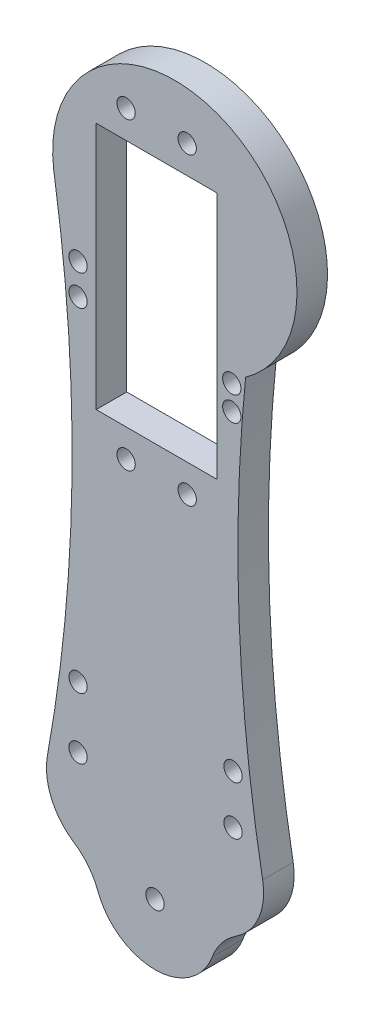
ISO-10303-21;
HEADER;
FILE_DESCRIPTION(('STEP AP214'),'2;1');
FILE_NAME('part.step','',(''),(''),'','','');
FILE_SCHEMA(('AUTOMOTIVE_DESIGN { 1 0 10303 214 1 1 1 1 }'));
ENDSEC;
DATA;
#1=APPLICATION_CONTEXT('core data for automotive mechanical design processes');
#2=APPLICATION_PROTOCOL_DEFINITION('international standard','automotive_design',2000,#1);
#3=PRODUCT_CONTEXT('',#1,'mechanical');
#4=PRODUCT('Part','Part','',(#3));
#5=PRODUCT_RELATED_PRODUCT_CATEGORY('part','',(#4));
#6=PRODUCT_DEFINITION_FORMATION('','',#4);
#7=PRODUCT_DEFINITION_CONTEXT('part definition',#1,'design');
#8=PRODUCT_DEFINITION('design','',#6,#7);
#9=PRODUCT_DEFINITION_SHAPE('','',#8);
#10=(LENGTH_UNIT() NAMED_UNIT(*) SI_UNIT(.MILLI.,.METRE.));
#11=(NAMED_UNIT(*) PLANE_ANGLE_UNIT() SI_UNIT($,.RADIAN.));
#12=(NAMED_UNIT(*) SI_UNIT($,.STERADIAN.) SOLID_ANGLE_UNIT());
#13=UNCERTAINTY_MEASURE_WITH_UNIT(LENGTH_MEASURE(1.E-05),#10,'distance_accuracy_value','');
#14=(GEOMETRIC_REPRESENTATION_CONTEXT(3) GLOBAL_UNCERTAINTY_ASSIGNED_CONTEXT((#13)) GLOBAL_UNIT_ASSIGNED_CONTEXT((#10,
#11,#12)) REPRESENTATION_CONTEXT('',''));
#15=CARTESIAN_POINT('',(0.,0.,0.));
#16=DIRECTION('',(0.,0.,1.));
#17=DIRECTION('',(1.,0.,0.));
#18=AXIS2_PLACEMENT_3D('',#15,#16,#17);
#19=CARTESIAN_POINT('',(263.569146060618,56.3388949776364,5.));
#20=DIRECTION('',(0.,0.,-1.));
#21=DIRECTION('',(-1.,0.,0.));
#22=AXIS2_PLACEMENT_3D('',#19,#20,#21);
#23=CYLINDRICAL_SURFACE('',#22,250.);
#24=CARTESIAN_POINT('',(263.569146060618,56.3388949776364,5.));
#25=DIRECTION('',(0.,0.,1.));
#26=DIRECTION('',(1.,0.,0.));
#27=AXIS2_PLACEMENT_3D('',#24,#25,#26);
#28=CIRCLE('',#27,250.);
#29=CARTESIAN_POINT('',(17.6154614259409,11.5417408869401,5.));
#30=VERTEX_POINT('',#29);
#31=CARTESIAN_POINT('',(14.8299436653512,81.4149630858208,5.));
#32=VERTEX_POINT('',#31);
#33=EDGE_CURVE('E179',#30,#32,#28,.F.);
#34=ORIENTED_EDGE('',*,*,#33,.F.);
#35=DIRECTION('',(0.,0.,-1.));
#36=VECTOR('',#35,1.);
#37=CARTESIAN_POINT('',(17.6154614259408,11.5417408869401,5.));
#38=LINE('',#37,#36);
#39=CARTESIAN_POINT('',(17.6154614259409,11.5417408869401,0.));
#40=VERTEX_POINT('',#39);
#41=EDGE_CURVE('E211',#30,#40,#38,.T.);
#42=ORIENTED_EDGE('',*,*,#41,.T.);
#43=CARTESIAN_POINT('',(263.569146060618,56.3388949776364,0.));
#44=DIRECTION('',(0.,0.,1.));
#45=DIRECTION('',(1.,0.,0.));
#46=AXIS2_PLACEMENT_3D('',#43,#44,#45);
#47=CIRCLE('',#46,250.);
#48=CARTESIAN_POINT('',(14.8299436653512,81.4149630858208,0.));
#49=VERTEX_POINT('',#48);
#50=EDGE_CURVE('E175',#40,#49,#47,.F.);
#51=ORIENTED_EDGE('',*,*,#50,.T.);
#52=DIRECTION('',(0.,0.,-1.));
#53=VECTOR('',#52,1.);
#54=CARTESIAN_POINT('',(14.8299436653512,81.4149630858208,5.));
#55=LINE('',#54,#53);
#56=EDGE_CURVE('E208',#32,#49,#55,.T.);
#57=ORIENTED_EDGE('',*,*,#56,.F.);
#58=EDGE_LOOP('',(#34,#42,#51,#57));
#59=FACE_BOUND('',#58,.T.);
#60=ADVANCED_FACE('F34',(#59),#23,.F.);
#61=CARTESIAN_POINT('',(3.24159201282626,97.7155798219269,5.));
#62=DIRECTION('',(0.,0.,-1.));
#63=DIRECTION('',(-1.,0.,0.));
#64=AXIS2_PLACEMENT_3D('',#61,#62,#63);
#65=CYLINDRICAL_SURFACE('',#64,20.);
#66=CARTESIAN_POINT('',(3.24159201282626,97.7155798219269,0.));
#67=DIRECTION('',(0.,0.,1.));
#68=DIRECTION('',(1.,0.,0.));
#69=AXIS2_PLACEMENT_3D('',#66,#67,#68);
#70=CIRCLE('',#69,20.);
#71=CARTESIAN_POINT('',(-16.5765244711894,95.0244352650541,0.));
#72=VERTEX_POINT('',#71);
#73=EDGE_CURVE('E194',#49,#72,#70,.T.);
#74=ORIENTED_EDGE('',*,*,#73,.T.);
#75=DIRECTION('',(0.,0.,-1.));
#76=VECTOR('',#75,1.);
#77=CARTESIAN_POINT('',(-16.5765244711894,95.0244352650541,5.));
#78=LINE('',#77,#76);
#79=CARTESIAN_POINT('',(-16.5765244711894,95.0244352650541,5.));
#80=VERTEX_POINT('',#79);
#81=EDGE_CURVE('E206',#80,#72,#78,.T.);
#82=ORIENTED_EDGE('',*,*,#81,.F.);
#83=CARTESIAN_POINT('',(3.24159201282626,97.7155798219269,5.));
#84=DIRECTION('',(0.,0.,1.));
#85=DIRECTION('',(1.,0.,0.));
#86=AXIS2_PLACEMENT_3D('',#83,#84,#85);
#87=CIRCLE('',#86,20.);
#88=EDGE_CURVE('E181',#32,#80,#87,.T.);
#89=ORIENTED_EDGE('',*,*,#88,.F.);
#90=ORIENTED_EDGE('',*,*,#56,.T.);
#91=EDGE_LOOP('',(#74,#82,#89,#90));
#92=FACE_BOUND('',#91,.T.);
#93=ADVANCED_FACE('F276',(#92),#65,.T.);
#94=CARTESIAN_POINT('',(-2.18344410291627,-0.329576970241774,5.));
#95=DIRECTION('',(-0.98879905314421,-0.149252914548141,0.));
#96=DIRECTION('',(0.149252914548141,-0.98879905314421,0.));
#97=AXIS2_PLACEMENT_3D('',#94,#95,#96);
#98=PLANE('',#97);
#99=DIRECTION('',(-0.149252914548141,0.98879905314421,0.));
#100=VECTOR('',#99,1.);
#101=CARTESIAN_POINT('',(-2.18344410291627,-0.329576970241774,0.));
#102=LINE('',#101,#100);
#103=CARTESIAN_POINT('',(-16.369382774566,93.6521236146717,0.));
#104=VERTEX_POINT('',#103);
#105=EDGE_CURVE('E197',#104,#72,#102,.T.);
#106=ORIENTED_EDGE('',*,*,#105,.F.);
#107=DIRECTION('',(0.,0.,-1.));
#108=VECTOR('',#107,1.);
#109=CARTESIAN_POINT('',(-16.369382774566,93.6521236146717,5.));
#110=LINE('',#109,#108);
#111=CARTESIAN_POINT('',(-16.369382774566,93.6521236146717,5.));
#112=VERTEX_POINT('',#111);
#113=EDGE_CURVE('E192',#112,#104,#110,.T.);
#114=ORIENTED_EDGE('',*,*,#113,.F.);
#115=DIRECTION('',(-0.149252914548141,0.98879905314421,0.));
#116=VECTOR('',#115,1.);
#117=CARTESIAN_POINT('',(-2.18344410291627,-0.329576970241774,5.));
#118=LINE('',#117,#116);
#119=EDGE_CURVE('E184',#112,#80,#118,.T.);
#120=ORIENTED_EDGE('',*,*,#119,.T.);
#121=ORIENTED_EDGE('',*,*,#81,.T.);
#122=EDGE_LOOP('',(#106,#114,#120,#121));
#123=FACE_BOUND('',#122,.T.);
#124=ADVANCED_FACE('F282',(#123),#98,.T.);
#125=CARTESIAN_POINT('',(-263.569146060618,56.3388949776364,5.));
#126=DIRECTION('',(0.,0.,-1.));
#127=DIRECTION('',(-1.,0.,0.));
#128=AXIS2_PLACEMENT_3D('',#125,#126,#127);
#129=CYLINDRICAL_SURFACE('',#128,250.);
#130=CARTESIAN_POINT('',(-263.569146060618,56.3388949776364,0.));
#131=DIRECTION('',(0.,0.,1.));
#132=DIRECTION('',(1.,0.,0.));
#133=AXIS2_PLACEMENT_3D('',#130,#131,#132);
#134=CIRCLE('',#133,250.);
#135=CARTESIAN_POINT('',(-17.6154614259409,11.5417408869394,0.));
#136=VERTEX_POINT('',#135);
#137=EDGE_CURVE('E200',#136,#104,#134,.T.);
#138=ORIENTED_EDGE('',*,*,#137,.F.);
#139=DIRECTION('',(0.,0.,-1.));
#140=VECTOR('',#139,1.);
#141=CARTESIAN_POINT('',(-17.6154614259409,11.5417408869394,5.));
#142=LINE('',#141,#140);
#143=CARTESIAN_POINT('',(-17.615461425941,11.5417408869395,5.));
#144=VERTEX_POINT('',#143);
#145=EDGE_CURVE('E224',#136,#144,#142,.F.);
#146=ORIENTED_EDGE('',*,*,#145,.T.);
#147=CARTESIAN_POINT('',(-263.569146060618,56.3388949776364,5.));
#148=DIRECTION('',(0.,0.,1.));
#149=DIRECTION('',(1.,0.,0.));
#150=AXIS2_PLACEMENT_3D('',#147,#148,#149);
#151=CIRCLE('',#150,250.);
#152=EDGE_CURVE('E187',#144,#112,#151,.T.);
#153=ORIENTED_EDGE('',*,*,#152,.T.);
#154=ORIENTED_EDGE('',*,*,#113,.T.);
#155=EDGE_LOOP('',(#138,#146,#153,#154));
#156=FACE_BOUND('',#155,.T.);
#157=ADVANCED_FACE('F330',(#156),#129,.F.);
#158=CARTESIAN_POINT('',(0.,0.,5.));
#159=DIRECTION('',(0.,0.,-1.));
#160=DIRECTION('',(-1.,0.,0.));
#161=AXIS2_PLACEMENT_3D('',#158,#159,#160);
#162=CYLINDRICAL_SURFACE('',#161,10.);
#163=CARTESIAN_POINT('',(0.,0.,5.));
#164=DIRECTION('',(0.,0.,1.));
#165=DIRECTION('',(1.,0.,0.));
#166=AXIS2_PLACEMENT_3D('',#163,#164,#165);
#167=CIRCLE('',#166,10.);
#168=CARTESIAN_POINT('',(-9.37212768633296,-3.48758120064195,5.));
#169=VERTEX_POINT('',#168);
#170=CARTESIAN_POINT('',(9.37212768633315,-3.48758120064144,5.));
#171=VERTEX_POINT('',#170);
#172=EDGE_CURVE('E189',#169,#171,#167,.T.);
#173=ORIENTED_EDGE('',*,*,#172,.F.);
#174=DIRECTION('',(0.,0.,-1.));
#175=VECTOR('',#174,1.);
#176=CARTESIAN_POINT('',(-9.37212768633296,-3.48758120064195,5.));
#177=LINE('',#176,#175);
#178=CARTESIAN_POINT('',(-9.37212768633296,-3.48758120064195,0.));
#179=VERTEX_POINT('',#178);
#180=EDGE_CURVE('E228',#169,#179,#177,.T.);
#181=ORIENTED_EDGE('',*,*,#180,.T.);
#182=CARTESIAN_POINT('',(0.,0.,0.));
#183=DIRECTION('',(0.,0.,1.));
#184=DIRECTION('',(1.,0.,0.));
#185=AXIS2_PLACEMENT_3D('',#182,#183,#184);
#186=CIRCLE('',#185,10.);
#187=CARTESIAN_POINT('',(9.37212768633315,-3.48758120064144,0.));
#188=VERTEX_POINT('',#187);
#189=EDGE_CURVE('E182',#179,#188,#186,.T.);
#190=ORIENTED_EDGE('',*,*,#189,.T.);
#191=DIRECTION('',(0.,0.,-1.));
#192=VECTOR('',#191,1.);
#193=CARTESIAN_POINT('',(9.37212768633315,-3.48758120064144,5.));
#194=LINE('',#193,#192);
#195=EDGE_CURVE('E226',#188,#171,#194,.F.);
#196=ORIENTED_EDGE('',*,*,#195,.T.);
#197=EDGE_LOOP('',(#173,#181,#190,#196));
#198=FACE_BOUND('',#197,.T.);
#199=ADVANCED_FACE('F312',(#198),#162,.T.);
#200=CARTESIAN_POINT('',(0.,0.,5.));
#201=DIRECTION('',(0.,0.,1.));
#202=DIRECTION('',(1.,0.,0.));
#203=AXIS2_PLACEMENT_3D('',#200,#201,#202);
#204=PLANE('',#203);
#205=CARTESIAN_POINT('',(12.77,24.54,5.));
#206=DIRECTION('',(0.,0.,-1.));
#207=DIRECTION('',(-1.,0.,0.));
#208=AXIS2_PLACEMENT_3D('',#205,#206,#207);
#209=CIRCLE('',#208,1.5);
#210=CARTESIAN_POINT('',(11.27,24.54,5.));
#211=VERTEX_POINT('',#210);
#212=EDGE_CURVE('E514',#211,#211,#209,.T.);
#213=ORIENTED_EDGE('',*,*,#212,.T.);
#214=EDGE_LOOP('',(#213));
#215=FACE_BOUND('',#214,.T.);
#216=CARTESIAN_POINT('',(12.57,75.41,5.));
#217=DIRECTION('',(0.,0.,-1.));
#218=DIRECTION('',(-1.,0.,0.));
#219=AXIS2_PLACEMENT_3D('',#216,#217,#218);
#220=CIRCLE('',#219,1.5);
#221=CARTESIAN_POINT('',(11.07,75.41,5.));
#222=VERTEX_POINT('',#221);
#223=EDGE_CURVE('E518',#222,#222,#220,.T.);
#224=ORIENTED_EDGE('',*,*,#223,.T.);
#225=EDGE_LOOP('',(#224));
#226=FACE_BOUND('',#225,.T.);
#227=CARTESIAN_POINT('',(12.57,79.41,5.));
#228=DIRECTION('',(0.,0.,-1.));
#229=DIRECTION('',(-1.,0.,0.));
#230=AXIS2_PLACEMENT_3D('',#227,#228,#229);
#231=CIRCLE('',#230,1.5);
#232=CARTESIAN_POINT('',(11.07,79.41,5.));
#233=VERTEX_POINT('',#232);
#234=EDGE_CURVE('E528',#233,#233,#231,.T.);
#235=ORIENTED_EDGE('',*,*,#234,.T.);
#236=EDGE_LOOP('',(#235));
#237=FACE_BOUND('',#236,.T.);
#238=CARTESIAN_POINT('',(12.77,16.54,5.));
#239=DIRECTION('',(0.,0.,-1.));
#240=DIRECTION('',(-1.,0.,0.));
#241=AXIS2_PLACEMENT_3D('',#238,#239,#240);
#242=CIRCLE('',#241,1.5);
#243=CARTESIAN_POINT('',(11.27,16.54,5.));
#244=VERTEX_POINT('',#243);
#245=EDGE_CURVE('E534',#244,#244,#242,.T.);
#246=ORIENTED_EDGE('',*,*,#245,.T.);
#247=EDGE_LOOP('',(#246));
#248=FACE_BOUND('',#247,.T.);
#249=CARTESIAN_POINT('',(-12.6,24.5,5.));
#250=DIRECTION('',(0.,0.,1.));
#251=DIRECTION('',(1.,0.,0.));
#252=AXIS2_PLACEMENT_3D('',#249,#250,#251);
#253=CIRCLE('',#252,1.5);
#254=CARTESIAN_POINT('',(-11.1,24.5,5.));
#255=VERTEX_POINT('',#254);
#256=EDGE_CURVE('E554',#255,#255,#253,.T.);
#257=ORIENTED_EDGE('',*,*,#256,.F.);
#258=EDGE_LOOP('',(#257));
#259=FACE_BOUND('',#258,.T.);
#260=CARTESIAN_POINT('',(-12.6,79.11,5.));
#261=DIRECTION('',(0.,0.,1.));
#262=DIRECTION('',(1.,0.,0.));
#263=AXIS2_PLACEMENT_3D('',#260,#261,#262);
#264=CIRCLE('',#263,1.5);
#265=CARTESIAN_POINT('',(-11.1,79.11,5.));
#266=VERTEX_POINT('',#265);
#267=EDGE_CURVE('E551',#266,#266,#264,.T.);
#268=ORIENTED_EDGE('',*,*,#267,.F.);
#269=EDGE_LOOP('',(#268));
#270=FACE_BOUND('',#269,.T.);
#271=CARTESIAN_POINT('',(-12.6,84.11,5.));
#272=DIRECTION('',(0.,0.,1.));
#273=DIRECTION('',(1.,0.,0.));
#274=AXIS2_PLACEMENT_3D('',#271,#272,#273);
#275=CIRCLE('',#274,1.5);
#276=CARTESIAN_POINT('',(-11.1,84.11,5.));
#277=VERTEX_POINT('',#276);
#278=EDGE_CURVE('E543',#277,#277,#275,.T.);
#279=ORIENTED_EDGE('',*,*,#278,.F.);
#280=EDGE_LOOP('',(#279));
#281=FACE_BOUND('',#280,.T.);
#282=CARTESIAN_POINT('',(-12.6,14.5,5.));
#283=DIRECTION('',(0.,0.,1.));
#284=DIRECTION('',(1.,0.,0.));
#285=AXIS2_PLACEMENT_3D('',#282,#283,#284);
#286=CIRCLE('',#285,1.5);
#287=CARTESIAN_POINT('',(-11.1,14.5,5.));
#288=VERTEX_POINT('',#287);
#289=EDGE_CURVE('E560',#288,#288,#286,.T.);
#290=ORIENTED_EDGE('',*,*,#289,.F.);
#291=EDGE_LOOP('',(#290));
#292=FACE_BOUND('',#291,.T.);
#293=DIRECTION('',(0.,-1.,0.));
#294=VECTOR('',#293,1.);
#295=CARTESIAN_POINT('',(-9.63243502849118,105.19,5.));
#296=LINE('',#295,#294);
#297=CARTESIAN_POINT('',(-9.63243502849118,105.19,5.));
#298=VERTEX_POINT('',#297);
#299=CARTESIAN_POINT('',(-9.63243502849117,64.59,5.));
#300=VERTEX_POINT('',#299);
#301=EDGE_CURVE('E49',#298,#300,#296,.T.);
#302=ORIENTED_EDGE('',*,*,#301,.F.);
#303=DIRECTION('',(-1.,0.,0.));
#304=VECTOR('',#303,1.);
#305=CARTESIAN_POINT('',(-9.63243502849118,105.19,5.));
#306=LINE('',#305,#304);
#307=CARTESIAN_POINT('',(10.1675649715088,105.19,5.));
#308=VERTEX_POINT('',#307);
#309=EDGE_CURVE('E148',#308,#298,#306,.T.);
#310=ORIENTED_EDGE('',*,*,#309,.F.);
#311=DIRECTION('',(0.,1.,0.));
#312=VECTOR('',#311,1.);
#313=CARTESIAN_POINT('',(10.1675649715088,105.19,5.));
#314=LINE('',#313,#312);
#315=CARTESIAN_POINT('',(10.1675649715088,64.59,5.));
#316=VERTEX_POINT('',#315);
#317=EDGE_CURVE('E132',#316,#308,#314,.T.);
#318=ORIENTED_EDGE('',*,*,#317,.F.);
#319=DIRECTION('',(1.,0.,0.));
#320=VECTOR('',#319,1.);
#321=CARTESIAN_POINT('',(-9.63243502849117,64.59,5.));
#322=LINE('',#321,#320);
#323=EDGE_CURVE('E141',#300,#316,#322,.T.);
#324=ORIENTED_EDGE('',*,*,#323,.F.);
#325=EDGE_LOOP('',(#302,#310,#318,#324));
#326=FACE_BOUND('',#325,.T.);
#327=CARTESIAN_POINT('',(5.26756497150882,109.78,5.));
#328=DIRECTION('',(0.,0.,1.));
#329=DIRECTION('',(1.,0.,0.));
#330=AXIS2_PLACEMENT_3D('',#327,#328,#329);
#331=CIRCLE('',#330,1.5);
#332=CARTESIAN_POINT('',(6.76756497150882,109.78,5.));
#333=VERTEX_POINT('',#332);
#334=EDGE_CURVE('E158',#333,#333,#331,.T.);
#335=ORIENTED_EDGE('',*,*,#334,.F.);
#336=EDGE_LOOP('',(#335));
#337=FACE_BOUND('',#336,.T.);
#338=CARTESIAN_POINT('',(-4.73243502849118,60.,5.));
#339=DIRECTION('',(0.,0.,1.));
#340=DIRECTION('',(1.,0.,0.));
#341=AXIS2_PLACEMENT_3D('',#338,#339,#340);
#342=CIRCLE('',#341,1.5);
#343=CARTESIAN_POINT('',(-3.23243502849118,60.,5.));
#344=VERTEX_POINT('',#343);
#345=EDGE_CURVE('E162',#344,#344,#342,.T.);
#346=ORIENTED_EDGE('',*,*,#345,.F.);
#347=EDGE_LOOP('',(#346));
#348=FACE_BOUND('',#347,.T.);
#349=CARTESIAN_POINT('',(5.26756497150882,60.,5.));
#350=DIRECTION('',(0.,0.,1.));
#351=DIRECTION('',(1.,0.,0.));
#352=AXIS2_PLACEMENT_3D('',#349,#350,#351);
#353=CIRCLE('',#352,1.5);
#354=CARTESIAN_POINT('',(6.76756497150883,60.,5.));
#355=VERTEX_POINT('',#354);
#356=EDGE_CURVE('E155',#355,#355,#353,.T.);
#357=ORIENTED_EDGE('',*,*,#356,.F.);
#358=EDGE_LOOP('',(#357));
#359=FACE_BOUND('',#358,.T.);
#360=CARTESIAN_POINT('',(-4.73243502849118,109.78,5.));
#361=DIRECTION('',(0.,0.,1.));
#362=DIRECTION('',(1.,0.,0.));
#363=AXIS2_PLACEMENT_3D('',#360,#361,#362);
#364=CIRCLE('',#363,1.5);
#365=CARTESIAN_POINT('',(-3.23243502849118,109.78,5.));
#366=VERTEX_POINT('',#365);
#367=EDGE_CURVE('E167',#366,#366,#364,.T.);
#368=ORIENTED_EDGE('',*,*,#367,.F.);
#369=EDGE_LOOP('',(#368));
#370=FACE_BOUND('',#369,.T.);
#371=CARTESIAN_POINT('',(0.,0.,5.));
#372=DIRECTION('',(0.,0.,1.));
#373=DIRECTION('',(1.,0.,0.));
#374=AXIS2_PLACEMENT_3D('',#371,#372,#373);
#375=CIRCLE('',#374,1.5);
#376=CARTESIAN_POINT('',(1.5,0.,5.));
#377=VERTEX_POINT('',#376);
#378=EDGE_CURVE('E176',#377,#377,#375,.T.);
#379=ORIENTED_EDGE('',*,*,#378,.F.);
#380=EDGE_LOOP('',(#379));
#381=FACE_BOUND('',#380,.T.);
#382=CARTESIAN_POINT('',(-7.77731404055385,9.74985472331157,5.));
#383=DIRECTION('',(0.,0.,1.));
#384=DIRECTION('',(1.,0.,0.));
#385=AXIS2_PLACEMENT_3D('',#382,#383,#384);
#386=CIRCLE('',#385,10.);
#387=CARTESIAN_POINT('',(-13.2607847066099,1.38734616101384,5.));
#388=VERTEX_POINT('',#387);
#389=EDGE_CURVE('E219',#144,#388,#386,.T.);
#390=ORIENTED_EDGE('',*,*,#389,.T.);
#391=CARTESIAN_POINT('',(-18.7442553726659,-6.9751624012839,5.));
#392=DIRECTION('',(0.,0.,1.));
#393=DIRECTION('',(1.,0.,0.));
#394=AXIS2_PLACEMENT_3D('',#391,#392,#393);
#395=CIRCLE('',#394,10.);
#396=EDGE_CURVE('E238',#388,#169,#395,.F.);
#397=ORIENTED_EDGE('',*,*,#396,.T.);
#398=ORIENTED_EDGE('',*,*,#172,.T.);
#399=CARTESIAN_POINT('',(18.7442553726663,-6.97516240128287,5.));
#400=DIRECTION('',(0.,0.,1.));
#401=DIRECTION('',(1.,0.,0.));
#402=AXIS2_PLACEMENT_3D('',#399,#400,#401);
#403=CIRCLE('',#402,10.);
#404=CARTESIAN_POINT('',(13.26078470661,1.3873461610147,5.));
#405=VERTEX_POINT('',#404);
#406=EDGE_CURVE('E242',#171,#405,#403,.F.);
#407=ORIENTED_EDGE('',*,*,#406,.T.);
#408=CARTESIAN_POINT('',(7.77731404055373,9.74985472331227,5.));
#409=DIRECTION('',(0.,0.,1.));
#410=DIRECTION('',(1.,0.,0.));
#411=AXIS2_PLACEMENT_3D('',#408,#409,#410);
#412=CIRCLE('',#411,10.);
#413=EDGE_CURVE('E222',#405,#30,#412,.T.);
#414=ORIENTED_EDGE('',*,*,#413,.T.);
#415=ORIENTED_EDGE('',*,*,#33,.T.);
#416=ORIENTED_EDGE('',*,*,#88,.T.);
#417=ORIENTED_EDGE('',*,*,#119,.F.);
#418=ORIENTED_EDGE('',*,*,#152,.F.);
#419=EDGE_LOOP('',(#390,#397,#398,#407,#414,#415,#416,#417,#418));
#420=FACE_BOUND('',#419,.T.);
#421=ADVANCED_FACE('F145',(#215,#226,#237,#248,#259,#270,#281,#292,#326,#337,#348,#359,#370,
#381,#420),#204,.T.);
#422=CARTESIAN_POINT('',(0.,0.,0.));
#423=DIRECTION('',(0.,0.,1.));
#424=DIRECTION('',(1.,0.,0.));
#425=AXIS2_PLACEMENT_3D('',#422,#423,#424);
#426=PLANE('',#425);
#427=CARTESIAN_POINT('',(12.77,24.54,0.));
#428=DIRECTION('',(0.,0.,-1.));
#429=DIRECTION('',(-1.,0.,0.));
#430=AXIS2_PLACEMENT_3D('',#427,#428,#429);
#431=CIRCLE('',#430,1.5);
#432=CARTESIAN_POINT('',(11.27,24.54,0.));
#433=VERTEX_POINT('',#432);
#434=EDGE_CURVE('E517',#433,#433,#431,.T.);
#435=ORIENTED_EDGE('',*,*,#434,.F.);
#436=EDGE_LOOP('',(#435));
#437=FACE_BOUND('',#436,.T.);
#438=CARTESIAN_POINT('',(12.57,75.41,0.));
#439=DIRECTION('',(0.,0.,-1.));
#440=DIRECTION('',(-1.,0.,0.));
#441=AXIS2_PLACEMENT_3D('',#438,#439,#440);
#442=CIRCLE('',#441,1.5);
#443=CARTESIAN_POINT('',(11.07,75.41,0.));
#444=VERTEX_POINT('',#443);
#445=EDGE_CURVE('E523',#444,#444,#442,.T.);
#446=ORIENTED_EDGE('',*,*,#445,.F.);
#447=EDGE_LOOP('',(#446));
#448=FACE_BOUND('',#447,.T.);
#449=CARTESIAN_POINT('',(12.57,79.41,0.));
#450=DIRECTION('',(0.,0.,-1.));
#451=DIRECTION('',(-1.,0.,0.));
#452=AXIS2_PLACEMENT_3D('',#449,#450,#451);
#453=CIRCLE('',#452,1.5);
#454=CARTESIAN_POINT('',(11.07,79.41,0.));
#455=VERTEX_POINT('',#454);
#456=EDGE_CURVE('E531',#455,#455,#453,.T.);
#457=ORIENTED_EDGE('',*,*,#456,.F.);
#458=EDGE_LOOP('',(#457));
#459=FACE_BOUND('',#458,.T.);
#460=CARTESIAN_POINT('',(12.77,16.54,0.));
#461=DIRECTION('',(0.,0.,-1.));
#462=DIRECTION('',(-1.,0.,0.));
#463=AXIS2_PLACEMENT_3D('',#460,#461,#462);
#464=CIRCLE('',#463,1.5);
#465=CARTESIAN_POINT('',(11.27,16.54,0.));
#466=VERTEX_POINT('',#465);
#467=EDGE_CURVE('E520',#466,#466,#464,.T.);
#468=ORIENTED_EDGE('',*,*,#467,.F.);
#469=EDGE_LOOP('',(#468));
#470=FACE_BOUND('',#469,.T.);
#471=CARTESIAN_POINT('',(-12.6,24.5,0.));
#472=DIRECTION('',(0.,0.,-1.));
#473=DIRECTION('',(-1.,0.,0.));
#474=AXIS2_PLACEMENT_3D('',#471,#472,#473);
#475=CIRCLE('',#474,1.5);
#476=CARTESIAN_POINT('',(-14.1,24.5,0.));
#477=VERTEX_POINT('',#476);
#478=EDGE_CURVE('E540',#477,#477,#475,.T.);
#479=ORIENTED_EDGE('',*,*,#478,.F.);
#480=EDGE_LOOP('',(#479));
#481=FACE_BOUND('',#480,.T.);
#482=CARTESIAN_POINT('',(-12.6,79.11,0.));
#483=DIRECTION('',(0.,0.,-1.));
#484=DIRECTION('',(-1.,0.,0.));
#485=AXIS2_PLACEMENT_3D('',#482,#483,#484);
#486=CIRCLE('',#485,1.5);
#487=CARTESIAN_POINT('',(-14.1,79.11,0.));
#488=VERTEX_POINT('',#487);
#489=EDGE_CURVE('E544',#488,#488,#486,.T.);
#490=ORIENTED_EDGE('',*,*,#489,.F.);
#491=EDGE_LOOP('',(#490));
#492=FACE_BOUND('',#491,.T.);
#493=CARTESIAN_POINT('',(-12.6,84.11,0.));
#494=DIRECTION('',(0.,0.,-1.));
#495=DIRECTION('',(-1.,0.,0.));
#496=AXIS2_PLACEMENT_3D('',#493,#494,#495);
#497=CIRCLE('',#496,1.5);
#498=CARTESIAN_POINT('',(-14.1,84.11,0.));
#499=VERTEX_POINT('',#498);
#500=EDGE_CURVE('E537',#499,#499,#497,.T.);
#501=ORIENTED_EDGE('',*,*,#500,.F.);
#502=EDGE_LOOP('',(#501));
#503=FACE_BOUND('',#502,.T.);
#504=CARTESIAN_POINT('',(-12.6,14.5,0.));
#505=DIRECTION('',(0.,0.,-1.));
#506=DIRECTION('',(-1.,0.,0.));
#507=AXIS2_PLACEMENT_3D('',#504,#505,#506);
#508=CIRCLE('',#507,1.5);
#509=CARTESIAN_POINT('',(-14.1,14.5,0.));
#510=VERTEX_POINT('',#509);
#511=EDGE_CURVE('E557',#510,#510,#508,.T.);
#512=ORIENTED_EDGE('',*,*,#511,.F.);
#513=EDGE_LOOP('',(#512));
#514=FACE_BOUND('',#513,.T.);
#515=DIRECTION('',(-1.,0.,0.));
#516=VECTOR('',#515,1.);
#517=CARTESIAN_POINT('',(0.,105.19,0.));
#518=LINE('',#517,#516);
#519=CARTESIAN_POINT('',(10.1675649715088,105.19,0.));
#520=VERTEX_POINT('',#519);
#521=CARTESIAN_POINT('',(-9.63243502849118,105.19,0.));
#522=VERTEX_POINT('',#521);
#523=EDGE_CURVE('E42',#520,#522,#518,.T.);
#524=ORIENTED_EDGE('',*,*,#523,.T.);
#525=DIRECTION('',(0.,-1.,0.));
#526=VECTOR('',#525,1.);
#527=CARTESIAN_POINT('',(-9.63243502849116,0.,0.));
#528=LINE('',#527,#526);
#529=CARTESIAN_POINT('',(-9.63243502849117,64.59,0.));
#530=VERTEX_POINT('',#529);
#531=EDGE_CURVE('E11',#522,#530,#528,.T.);
#532=ORIENTED_EDGE('',*,*,#531,.T.);
#533=DIRECTION('',(1.,0.,0.));
#534=VECTOR('',#533,1.);
#535=CARTESIAN_POINT('',(0.,64.59,0.));
#536=LINE('',#535,#534);
#537=CARTESIAN_POINT('',(10.1675649715088,64.59,0.));
#538=VERTEX_POINT('',#537);
#539=EDGE_CURVE('E244',#530,#538,#536,.T.);
#540=ORIENTED_EDGE('',*,*,#539,.T.);
#541=DIRECTION('',(0.,1.,0.));
#542=VECTOR('',#541,1.);
#543=CARTESIAN_POINT('',(10.1675649715088,0.,0.));
#544=LINE('',#543,#542);
#545=EDGE_CURVE('E135',#538,#520,#544,.T.);
#546=ORIENTED_EDGE('',*,*,#545,.T.);
#547=EDGE_LOOP('',(#524,#532,#540,#546));
#548=FACE_BOUND('',#547,.T.);
#549=CARTESIAN_POINT('',(5.26756497150882,109.78,0.));
#550=DIRECTION('',(0.,0.,1.));
#551=DIRECTION('',(1.,0.,0.));
#552=AXIS2_PLACEMENT_3D('',#549,#550,#551);
#553=CIRCLE('',#552,1.5);
#554=CARTESIAN_POINT('',(6.76756497150882,109.78,0.));
#555=VERTEX_POINT('',#554);
#556=EDGE_CURVE('E171',#555,#555,#553,.T.);
#557=ORIENTED_EDGE('',*,*,#556,.T.);
#558=EDGE_LOOP('',(#557));
#559=FACE_BOUND('',#558,.T.);
#560=CARTESIAN_POINT('',(-4.73243502849118,60.,0.));
#561=DIRECTION('',(0.,0.,1.));
#562=DIRECTION('',(1.,0.,0.));
#563=AXIS2_PLACEMENT_3D('',#560,#561,#562);
#564=CIRCLE('',#563,1.5);
#565=CARTESIAN_POINT('',(-3.23243502849118,60.,0.));
#566=VERTEX_POINT('',#565);
#567=EDGE_CURVE('E249',#566,#566,#564,.T.);
#568=ORIENTED_EDGE('',*,*,#567,.T.);
#569=EDGE_LOOP('',(#568));
#570=FACE_BOUND('',#569,.T.);
#571=CARTESIAN_POINT('',(5.26756497150882,60.,0.));
#572=DIRECTION('',(0.,0.,1.));
#573=DIRECTION('',(1.,0.,0.));
#574=AXIS2_PLACEMENT_3D('',#571,#572,#573);
#575=CIRCLE('',#574,1.5);
#576=CARTESIAN_POINT('',(6.76756497150883,60.,0.));
#577=VERTEX_POINT('',#576);
#578=EDGE_CURVE('E161',#577,#577,#575,.T.);
#579=ORIENTED_EDGE('',*,*,#578,.T.);
#580=EDGE_LOOP('',(#579));
#581=FACE_BOUND('',#580,.T.);
#582=CARTESIAN_POINT('',(-4.73243502849118,109.78,0.));
#583=DIRECTION('',(0.,0.,1.));
#584=DIRECTION('',(1.,0.,0.));
#585=AXIS2_PLACEMENT_3D('',#582,#583,#584);
#586=CIRCLE('',#585,1.5);
#587=CARTESIAN_POINT('',(-3.23243502849118,109.78,0.));
#588=VERTEX_POINT('',#587);
#589=EDGE_CURVE('E170',#588,#588,#586,.T.);
#590=ORIENTED_EDGE('',*,*,#589,.T.);
#591=EDGE_LOOP('',(#590));
#592=FACE_BOUND('',#591,.T.);
#593=CARTESIAN_POINT('',(0.,0.,0.));
#594=DIRECTION('',(0.,0.,1.));
#595=DIRECTION('',(1.,0.,0.));
#596=AXIS2_PLACEMENT_3D('',#593,#594,#595);
#597=CIRCLE('',#596,1.5);
#598=CARTESIAN_POINT('',(1.5,0.,0.));
#599=VERTEX_POINT('',#598);
#600=EDGE_CURVE('E172',#599,#599,#597,.T.);
#601=ORIENTED_EDGE('',*,*,#600,.T.);
#602=EDGE_LOOP('',(#601));
#603=FACE_BOUND('',#602,.T.);
#604=ORIENTED_EDGE('',*,*,#50,.F.);
#605=CARTESIAN_POINT('',(7.77731404055373,9.74985472331227,0.));
#606=DIRECTION('',(0.,0.,1.));
#607=DIRECTION('',(1.,0.,0.));
#608=AXIS2_PLACEMENT_3D('',#605,#606,#607);
#609=CIRCLE('',#608,10.);
#610=CARTESIAN_POINT('',(13.26078470661,1.3873461610147,0.));
#611=VERTEX_POINT('',#610);
#612=EDGE_CURVE('E216',#40,#611,#609,.F.);
#613=ORIENTED_EDGE('',*,*,#612,.T.);
#614=CARTESIAN_POINT('',(18.7442553726663,-6.97516240128287,0.));
#615=DIRECTION('',(0.,0.,1.));
#616=DIRECTION('',(1.,0.,0.));
#617=AXIS2_PLACEMENT_3D('',#614,#615,#616);
#618=CIRCLE('',#617,10.);
#619=EDGE_CURVE('E240',#611,#188,#618,.T.);
#620=ORIENTED_EDGE('',*,*,#619,.T.);
#621=ORIENTED_EDGE('',*,*,#189,.F.);
#622=CARTESIAN_POINT('',(-18.7442553726659,-6.9751624012839,0.));
#623=DIRECTION('',(0.,0.,1.));
#624=DIRECTION('',(1.,0.,0.));
#625=AXIS2_PLACEMENT_3D('',#622,#623,#624);
#626=CIRCLE('',#625,10.);
#627=CARTESIAN_POINT('',(-13.2607847066099,1.38734616101384,0.));
#628=VERTEX_POINT('',#627);
#629=EDGE_CURVE('E236',#179,#628,#626,.T.);
#630=ORIENTED_EDGE('',*,*,#629,.T.);
#631=CARTESIAN_POINT('',(-7.77731404055385,9.74985472331157,0.));
#632=DIRECTION('',(0.,0.,1.));
#633=DIRECTION('',(1.,0.,0.));
#634=AXIS2_PLACEMENT_3D('',#631,#632,#633);
#635=CIRCLE('',#634,10.);
#636=EDGE_CURVE('E214',#628,#136,#635,.F.);
#637=ORIENTED_EDGE('',*,*,#636,.T.);
#638=ORIENTED_EDGE('',*,*,#137,.T.);
#639=ORIENTED_EDGE('',*,*,#105,.T.);
#640=ORIENTED_EDGE('',*,*,#73,.F.);
#641=EDGE_LOOP('',(#604,#613,#620,#621,#630,#637,#638,#639,#640));
#642=FACE_BOUND('',#641,.T.);
#643=ADVANCED_FACE('F257',(#437,#448,#459,#470,#481,#492,#503,#514,#548,#559,#570,#581,#592,
#603,#642),#426,.F.);
#644=CARTESIAN_POINT('',(7.77731404055373,9.74985472331227,5.));
#645=DIRECTION('',(0.,0.,-1.));
#646=DIRECTION('',(-1.,0.,0.));
#647=AXIS2_PLACEMENT_3D('',#644,#645,#646);
#648=CYLINDRICAL_SURFACE('',#647,10.);
#649=ORIENTED_EDGE('',*,*,#413,.F.);
#650=DIRECTION('',(0.,0.,-1.));
#651=VECTOR('',#650,1.);
#652=CARTESIAN_POINT('',(13.26078470661,1.3873461610147,5.));
#653=LINE('',#652,#651);
#654=EDGE_CURVE('E233',#405,#611,#653,.T.);
#655=ORIENTED_EDGE('',*,*,#654,.T.);
#656=ORIENTED_EDGE('',*,*,#612,.F.);
#657=ORIENTED_EDGE('',*,*,#41,.F.);
#658=EDGE_LOOP('',(#649,#655,#656,#657));
#659=FACE_BOUND('',#658,.T.);
#660=ADVANCED_FACE('F288',(#659),#648,.T.);
#661=CARTESIAN_POINT('',(-7.77731404055385,9.74985472331157,5.));
#662=DIRECTION('',(0.,0.,-1.));
#663=DIRECTION('',(-1.,0.,0.));
#664=AXIS2_PLACEMENT_3D('',#661,#662,#663);
#665=CYLINDRICAL_SURFACE('',#664,10.);
#666=ORIENTED_EDGE('',*,*,#636,.F.);
#667=DIRECTION('',(0.,0.,-1.));
#668=VECTOR('',#667,1.);
#669=CARTESIAN_POINT('',(-13.2607847066099,1.38734616101384,5.));
#670=LINE('',#669,#668);
#671=EDGE_CURVE('E231',#628,#388,#670,.F.);
#672=ORIENTED_EDGE('',*,*,#671,.T.);
#673=ORIENTED_EDGE('',*,*,#389,.F.);
#674=ORIENTED_EDGE('',*,*,#145,.F.);
#675=EDGE_LOOP('',(#666,#672,#673,#674));
#676=FACE_BOUND('',#675,.T.);
#677=ADVANCED_FACE('F291',(#676),#665,.T.);
#678=CARTESIAN_POINT('',(-18.7442553726659,-6.9751624012839,5.));
#679=DIRECTION('',(0.,0.,1.));
#680=DIRECTION('',(1.,0.,0.));
#681=AXIS2_PLACEMENT_3D('',#678,#679,#680);
#682=CYLINDRICAL_SURFACE('',#681,10.);
#683=ORIENTED_EDGE('',*,*,#396,.F.);
#684=ORIENTED_EDGE('',*,*,#671,.F.);
#685=ORIENTED_EDGE('',*,*,#629,.F.);
#686=ORIENTED_EDGE('',*,*,#180,.F.);
#687=EDGE_LOOP('',(#683,#684,#685,#686));
#688=FACE_BOUND('',#687,.T.);
#689=ADVANCED_FACE('F294',(#688),#682,.F.);
#690=CARTESIAN_POINT('',(18.7442553726663,-6.97516240128287,5.));
#691=DIRECTION('',(0.,0.,1.));
#692=DIRECTION('',(1.,0.,0.));
#693=AXIS2_PLACEMENT_3D('',#690,#691,#692);
#694=CYLINDRICAL_SURFACE('',#693,10.);
#695=ORIENTED_EDGE('',*,*,#406,.F.);
#696=ORIENTED_EDGE('',*,*,#195,.F.);
#697=ORIENTED_EDGE('',*,*,#619,.F.);
#698=ORIENTED_EDGE('',*,*,#654,.F.);
#699=EDGE_LOOP('',(#695,#696,#697,#698));
#700=FACE_BOUND('',#699,.T.);
#701=ADVANCED_FACE('F36',(#700),#694,.F.);
#702=CARTESIAN_POINT('',(0.,0.,0.));
#703=DIRECTION('',(0.,0.,1.));
#704=DIRECTION('',(1.,0.,0.));
#705=AXIS2_PLACEMENT_3D('',#702,#703,#704);
#706=CYLINDRICAL_SURFACE('',#705,1.5);
#707=ORIENTED_EDGE('',*,*,#600,.F.);
#708=EDGE_LOOP('',(#707));
#709=FACE_BOUND('',#708,.T.);
#710=ORIENTED_EDGE('',*,*,#378,.T.);
#711=EDGE_LOOP('',(#710));
#712=FACE_BOUND('',#711,.T.);
#713=ADVANCED_FACE('F301',(#709,#712),#706,.F.);
#714=CARTESIAN_POINT('',(-4.73243502849118,109.78,-5.));
#715=DIRECTION('',(0.,0.,1.));
#716=DIRECTION('',(1.,0.,0.));
#717=AXIS2_PLACEMENT_3D('',#714,#715,#716);
#718=CYLINDRICAL_SURFACE('',#717,1.5);
#719=ORIENTED_EDGE('',*,*,#367,.T.);
#720=EDGE_LOOP('',(#719));
#721=FACE_BOUND('',#720,.T.);
#722=ORIENTED_EDGE('',*,*,#589,.F.);
#723=EDGE_LOOP('',(#722));
#724=FACE_BOUND('',#723,.T.);
#725=ADVANCED_FACE('F349',(#721,#724),#718,.F.);
#726=CARTESIAN_POINT('',(5.26756497150882,60.,-5.));
#727=DIRECTION('',(0.,0.,1.));
#728=DIRECTION('',(1.,0.,0.));
#729=AXIS2_PLACEMENT_3D('',#726,#727,#728);
#730=CYLINDRICAL_SURFACE('',#729,1.5);
#731=ORIENTED_EDGE('',*,*,#356,.T.);
#732=EDGE_LOOP('',(#731));
#733=FACE_BOUND('',#732,.T.);
#734=ORIENTED_EDGE('',*,*,#578,.F.);
#735=EDGE_LOOP('',(#734));
#736=FACE_BOUND('',#735,.T.);
#737=ADVANCED_FACE('F353',(#733,#736),#730,.F.);
#738=CARTESIAN_POINT('',(-4.73243502849118,60.,-5.));
#739=DIRECTION('',(0.,0.,1.));
#740=DIRECTION('',(1.,0.,0.));
#741=AXIS2_PLACEMENT_3D('',#738,#739,#740);
#742=CYLINDRICAL_SURFACE('',#741,1.5);
#743=ORIENTED_EDGE('',*,*,#345,.T.);
#744=EDGE_LOOP('',(#743));
#745=FACE_BOUND('',#744,.T.);
#746=ORIENTED_EDGE('',*,*,#567,.F.);
#747=EDGE_LOOP('',(#746));
#748=FACE_BOUND('',#747,.T.);
#749=ADVANCED_FACE('F271',(#745,#748),#742,.F.);
#750=CARTESIAN_POINT('',(5.26756497150882,109.78,-5.));
#751=DIRECTION('',(0.,0.,1.));
#752=DIRECTION('',(1.,0.,0.));
#753=AXIS2_PLACEMENT_3D('',#750,#751,#752);
#754=CYLINDRICAL_SURFACE('',#753,1.5);
#755=ORIENTED_EDGE('',*,*,#334,.T.);
#756=EDGE_LOOP('',(#755));
#757=FACE_BOUND('',#756,.T.);
#758=ORIENTED_EDGE('',*,*,#556,.F.);
#759=EDGE_LOOP('',(#758));
#760=FACE_BOUND('',#759,.T.);
#761=ADVANCED_FACE('F264',(#757,#760),#754,.F.);
#762=CARTESIAN_POINT('',(-9.63243502849118,105.19,-5.));
#763=DIRECTION('',(-1.,0.,0.));
#764=DIRECTION('',(0.,-1.,0.));
#765=AXIS2_PLACEMENT_3D('',#762,#763,#764);
#766=PLANE('',#765);
#767=DIRECTION('',(0.,0.,1.));
#768=VECTOR('',#767,1.);
#769=CARTESIAN_POINT('',(-9.63243502849118,105.19,-5.));
#770=LINE('',#769,#768);
#771=EDGE_CURVE('E153',#522,#298,#770,.T.);
#772=ORIENTED_EDGE('',*,*,#771,.T.);
#773=ORIENTED_EDGE('',*,*,#301,.T.);
#774=DIRECTION('',(0.,0.,1.));
#775=VECTOR('',#774,1.);
#776=CARTESIAN_POINT('',(-9.63243502849117,64.59,-5.));
#777=LINE('',#776,#775);
#778=EDGE_CURVE('E138',#530,#300,#777,.T.);
#779=ORIENTED_EDGE('',*,*,#778,.F.);
#780=ORIENTED_EDGE('',*,*,#531,.F.);
#781=EDGE_LOOP('',(#772,#773,#779,#780));
#782=FACE_BOUND('',#781,.T.);
#783=ADVANCED_FACE('F262',(#782),#766,.F.);
#784=CARTESIAN_POINT('',(-9.63243502849118,105.19,-5.));
#785=DIRECTION('',(0.,1.,0.));
#786=DIRECTION('',(0.,0.,1.));
#787=AXIS2_PLACEMENT_3D('',#784,#785,#786);
#788=PLANE('',#787);
#789=DIRECTION('',(0.,0.,1.));
#790=VECTOR('',#789,1.);
#791=CARTESIAN_POINT('',(10.1675649715088,105.19,-5.));
#792=LINE('',#791,#790);
#793=EDGE_CURVE('E137',#520,#308,#792,.T.);
#794=ORIENTED_EDGE('',*,*,#793,.T.);
#795=ORIENTED_EDGE('',*,*,#309,.T.);
#796=ORIENTED_EDGE('',*,*,#771,.F.);
#797=ORIENTED_EDGE('',*,*,#523,.F.);
#798=EDGE_LOOP('',(#794,#795,#796,#797));
#799=FACE_BOUND('',#798,.T.);
#800=ADVANCED_FACE('F261',(#799),#788,.F.);
#801=CARTESIAN_POINT('',(10.1675649715088,105.19,-5.));
#802=DIRECTION('',(1.,0.,0.));
#803=DIRECTION('',(0.,1.,0.));
#804=AXIS2_PLACEMENT_3D('',#801,#802,#803);
#805=PLANE('',#804);
#806=DIRECTION('',(0.,0.,1.));
#807=VECTOR('',#806,1.);
#808=CARTESIAN_POINT('',(10.1675649715088,64.59,-5.));
#809=LINE('',#808,#807);
#810=EDGE_CURVE('E57',#538,#316,#809,.T.);
#811=ORIENTED_EDGE('',*,*,#810,.T.);
#812=ORIENTED_EDGE('',*,*,#317,.T.);
#813=ORIENTED_EDGE('',*,*,#793,.F.);
#814=ORIENTED_EDGE('',*,*,#545,.F.);
#815=EDGE_LOOP('',(#811,#812,#813,#814));
#816=FACE_BOUND('',#815,.T.);
#817=ADVANCED_FACE('F129',(#816),#805,.F.);
#818=CARTESIAN_POINT('',(-9.63243502849117,64.59,-5.));
#819=DIRECTION('',(0.,-1.,0.));
#820=DIRECTION('',(0.,0.,-1.));
#821=AXIS2_PLACEMENT_3D('',#818,#819,#820);
#822=PLANE('',#821);
#823=ORIENTED_EDGE('',*,*,#778,.T.);
#824=ORIENTED_EDGE('',*,*,#323,.T.);
#825=ORIENTED_EDGE('',*,*,#810,.F.);
#826=ORIENTED_EDGE('',*,*,#539,.F.);
#827=EDGE_LOOP('',(#823,#824,#825,#826));
#828=FACE_BOUND('',#827,.T.);
#829=ADVANCED_FACE('F142',(#828),#822,.F.);
#830=CARTESIAN_POINT('',(-12.6,14.5,10.));
#831=DIRECTION('',(0.,0.,-1.));
#832=DIRECTION('',(-1.,0.,0.));
#833=AXIS2_PLACEMENT_3D('',#830,#831,#832);
#834=CYLINDRICAL_SURFACE('',#833,1.5);
#835=ORIENTED_EDGE('',*,*,#289,.T.);
#836=EDGE_LOOP('',(#835));
#837=FACE_BOUND('',#836,.T.);
#838=ORIENTED_EDGE('',*,*,#511,.T.);
#839=EDGE_LOOP('',(#838));
#840=FACE_BOUND('',#839,.T.);
#841=ADVANCED_FACE('F415',(#837,#840),#834,.F.);
#842=CARTESIAN_POINT('',(-12.6,84.11,10.));
#843=DIRECTION('',(0.,0.,-1.));
#844=DIRECTION('',(-1.,0.,0.));
#845=AXIS2_PLACEMENT_3D('',#842,#843,#844);
#846=CYLINDRICAL_SURFACE('',#845,1.5);
#847=ORIENTED_EDGE('',*,*,#278,.T.);
#848=EDGE_LOOP('',(#847));
#849=FACE_BOUND('',#848,.T.);
#850=ORIENTED_EDGE('',*,*,#500,.T.);
#851=EDGE_LOOP('',(#850));
#852=FACE_BOUND('',#851,.T.);
#853=ADVANCED_FACE('F423',(#849,#852),#846,.F.);
#854=CARTESIAN_POINT('',(-12.6,79.11,10.));
#855=DIRECTION('',(0.,0.,-1.));
#856=DIRECTION('',(-1.,0.,0.));
#857=AXIS2_PLACEMENT_3D('',#854,#855,#856);
#858=CYLINDRICAL_SURFACE('',#857,1.5);
#859=ORIENTED_EDGE('',*,*,#267,.T.);
#860=EDGE_LOOP('',(#859));
#861=FACE_BOUND('',#860,.T.);
#862=ORIENTED_EDGE('',*,*,#489,.T.);
#863=EDGE_LOOP('',(#862));
#864=FACE_BOUND('',#863,.T.);
#865=ADVANCED_FACE('F433',(#861,#864),#858,.F.);
#866=CARTESIAN_POINT('',(-12.6,24.5,10.));
#867=DIRECTION('',(0.,0.,-1.));
#868=DIRECTION('',(-1.,0.,0.));
#869=AXIS2_PLACEMENT_3D('',#866,#867,#868);
#870=CYLINDRICAL_SURFACE('',#869,1.5);
#871=ORIENTED_EDGE('',*,*,#256,.T.);
#872=EDGE_LOOP('',(#871));
#873=FACE_BOUND('',#872,.T.);
#874=ORIENTED_EDGE('',*,*,#478,.T.);
#875=EDGE_LOOP('',(#874));
#876=FACE_BOUND('',#875,.T.);
#877=ADVANCED_FACE('F443',(#873,#876),#870,.F.);
#878=CARTESIAN_POINT('',(12.77,16.54,5.));
#879=DIRECTION('',(0.,0.,-1.));
#880=DIRECTION('',(-1.,0.,0.));
#881=AXIS2_PLACEMENT_3D('',#878,#879,#880);
#882=CYLINDRICAL_SURFACE('',#881,1.5);
#883=ORIENTED_EDGE('',*,*,#245,.F.);
#884=EDGE_LOOP('',(#883));
#885=FACE_BOUND('',#884,.T.);
#886=ORIENTED_EDGE('',*,*,#467,.T.);
#887=EDGE_LOOP('',(#886));
#888=FACE_BOUND('',#887,.T.);
#889=ADVANCED_FACE('F453',(#885,#888),#882,.F.);
#890=CARTESIAN_POINT('',(12.57,79.41,5.));
#891=DIRECTION('',(0.,0.,-1.));
#892=DIRECTION('',(-1.,0.,0.));
#893=AXIS2_PLACEMENT_3D('',#890,#891,#892);
#894=CYLINDRICAL_SURFACE('',#893,1.5);
#895=ORIENTED_EDGE('',*,*,#234,.F.);
#896=EDGE_LOOP('',(#895));
#897=FACE_BOUND('',#896,.T.);
#898=ORIENTED_EDGE('',*,*,#456,.T.);
#899=EDGE_LOOP('',(#898));
#900=FACE_BOUND('',#899,.T.);
#901=ADVANCED_FACE('F477',(#897,#900),#894,.F.);
#902=CARTESIAN_POINT('',(12.57,75.41,5.));
#903=DIRECTION('',(0.,0.,-1.));
#904=DIRECTION('',(-1.,0.,0.));
#905=AXIS2_PLACEMENT_3D('',#902,#903,#904);
#906=CYLINDRICAL_SURFACE('',#905,1.5);
#907=ORIENTED_EDGE('',*,*,#223,.F.);
#908=EDGE_LOOP('',(#907));
#909=FACE_BOUND('',#908,.T.);
#910=ORIENTED_EDGE('',*,*,#445,.T.);
#911=EDGE_LOOP('',(#910));
#912=FACE_BOUND('',#911,.T.);
#913=ADVANCED_FACE('F487',(#909,#912),#906,.F.);
#914=CARTESIAN_POINT('',(12.77,24.54,5.));
#915=DIRECTION('',(0.,0.,-1.));
#916=DIRECTION('',(-1.,0.,0.));
#917=AXIS2_PLACEMENT_3D('',#914,#915,#916);
#918=CYLINDRICAL_SURFACE('',#917,1.5);
#919=ORIENTED_EDGE('',*,*,#212,.F.);
#920=EDGE_LOOP('',(#919));
#921=FACE_BOUND('',#920,.T.);
#922=ORIENTED_EDGE('',*,*,#434,.T.);
#923=EDGE_LOOP('',(#922));
#924=FACE_BOUND('',#923,.T.);
#925=ADVANCED_FACE('F497',(#921,#924),#918,.F.);
#926=CLOSED_SHELL('',(#60,#93,#124,#157,#199,#421,#643,#660,#677,#689,#701,#713,#725,#737,#749,
#761,#783,#800,#817,#829,#841,#853,#865,#877,#889,#901,#913,#925));
#927=MANIFOLD_SOLID_BREP('B2',#926);
#928=ADVANCED_BREP_SHAPE_REPRESENTATION('',(#18,#927),#14);
#929=SHAPE_DEFINITION_REPRESENTATION(#9,#928);
ENDSEC;
END-ISO-10303-21;
